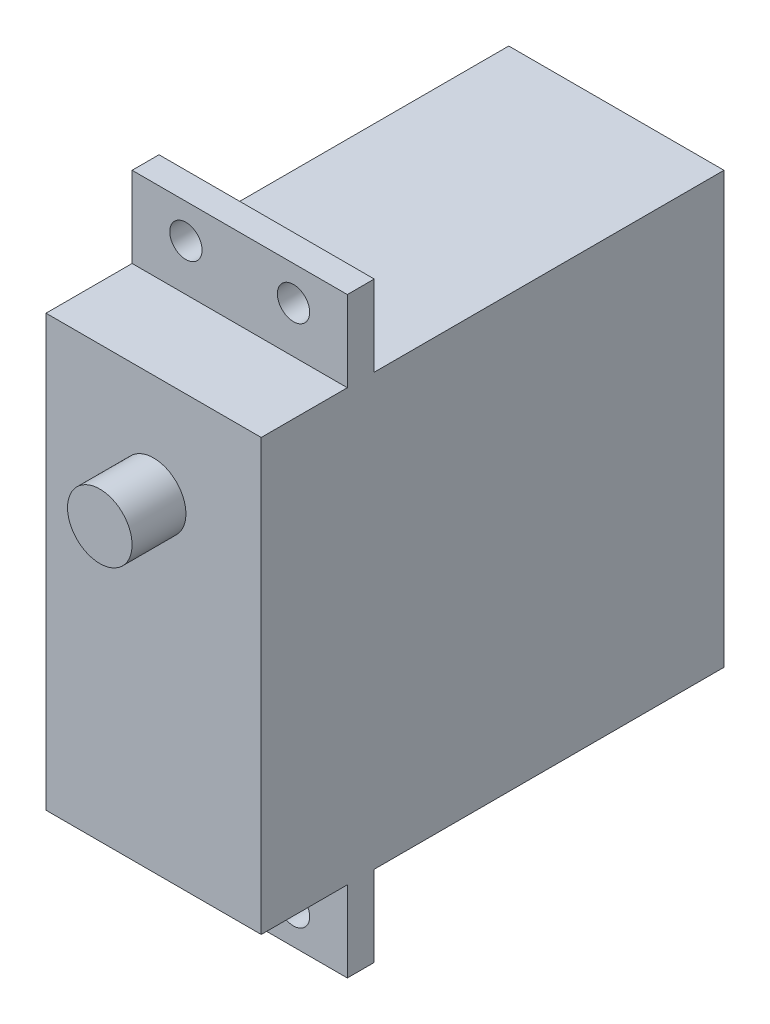
ISO-10303-21;
HEADER;
FILE_DESCRIPTION(('STEP AP214'),'2;1');
FILE_NAME('part.step','',(''),(''),'','','');
FILE_SCHEMA(('AUTOMOTIVE_DESIGN { 1 0 10303 214 1 1 1 1 }'));
ENDSEC;
DATA;
#1=APPLICATION_CONTEXT('core data for automotive mechanical design processes');
#2=APPLICATION_PROTOCOL_DEFINITION('international standard','automotive_design',2000,#1);
#3=PRODUCT_CONTEXT('',#1,'mechanical');
#4=PRODUCT('Part','Part','',(#3));
#5=PRODUCT_RELATED_PRODUCT_CATEGORY('part','',(#4));
#6=PRODUCT_DEFINITION_FORMATION('','',#4);
#7=PRODUCT_DEFINITION_CONTEXT('part definition',#1,'design');
#8=PRODUCT_DEFINITION('design','',#6,#7);
#9=PRODUCT_DEFINITION_SHAPE('','',#8);
#10=(LENGTH_UNIT() NAMED_UNIT(*) SI_UNIT(.MILLI.,.METRE.));
#11=(NAMED_UNIT(*) PLANE_ANGLE_UNIT() SI_UNIT($,.RADIAN.));
#12=(NAMED_UNIT(*) SI_UNIT($,.STERADIAN.) SOLID_ANGLE_UNIT());
#13=UNCERTAINTY_MEASURE_WITH_UNIT(LENGTH_MEASURE(1.E-05),#10,'distance_accuracy_value','');
#14=(GEOMETRIC_REPRESENTATION_CONTEXT(3) GLOBAL_UNCERTAINTY_ASSIGNED_CONTEXT((#13)) GLOBAL_UNIT_ASSIGNED_CONTEXT((#10,
#11,#12)) REPRESENTATION_CONTEXT('',''));
#15=CARTESIAN_POINT('',(0.,0.,0.));
#16=DIRECTION('',(0.,0.,1.));
#17=DIRECTION('',(1.,0.,0.));
#18=AXIS2_PLACEMENT_3D('',#15,#16,#17);
#19=CARTESIAN_POINT('',(0.,0.,43.));
#20=DIRECTION('',(0.,0.,-1.));
#21=DIRECTION('',(-1.,0.,0.));
#22=AXIS2_PLACEMENT_3D('',#19,#20,#21);
#23=PLANE('',#22);
#24=DIRECTION('',(0.,1.,0.));
#25=VECTOR('',#24,1.);
#26=CARTESIAN_POINT('',(10.,-20.,43.));
#27=LINE('',#26,#25);
#28=CARTESIAN_POINT('',(10.,-20.,43.));
#29=VERTEX_POINT('',#28);
#30=CARTESIAN_POINT('',(10.,20.,43.));
#31=VERTEX_POINT('',#30);
#32=EDGE_CURVE('E139',#29,#31,#27,.T.);
#33=ORIENTED_EDGE('',*,*,#32,.T.);
#34=DIRECTION('',(-1.,0.,0.));
#35=VECTOR('',#34,1.);
#36=CARTESIAN_POINT('',(-10.,20.,43.));
#37=LINE('',#36,#35);
#38=CARTESIAN_POINT('',(-10.,20.,43.));
#39=VERTEX_POINT('',#38);
#40=EDGE_CURVE('E129',#31,#39,#37,.T.);
#41=ORIENTED_EDGE('',*,*,#40,.T.);
#42=DIRECTION('',(0.,-1.,0.));
#43=VECTOR('',#42,1.);
#44=CARTESIAN_POINT('',(-10.,-20.,43.));
#45=LINE('',#44,#43);
#46=CARTESIAN_POINT('',(-10.,-20.,43.));
#47=VERTEX_POINT('',#46);
#48=EDGE_CURVE('E138',#39,#47,#45,.T.);
#49=ORIENTED_EDGE('',*,*,#48,.T.);
#50=DIRECTION('',(1.,0.,0.));
#51=VECTOR('',#50,1.);
#52=CARTESIAN_POINT('',(-10.,-20.,43.));
#53=LINE('',#52,#51);
#54=EDGE_CURVE('E144',#47,#29,#53,.T.);
#55=ORIENTED_EDGE('',*,*,#54,.T.);
#56=EDGE_LOOP('',(#33,#41,#49,#55));
#57=FACE_BOUND('',#56,.T.);
#58=CARTESIAN_POINT('',(0.,10.35,43.));
#59=DIRECTION('',(0.,0.,-1.));
#60=DIRECTION('',(-1.,0.,0.));
#61=AXIS2_PLACEMENT_3D('',#58,#59,#60);
#62=CIRCLE('',#61,3.);
#63=CARTESIAN_POINT('',(-3.,10.35,43.));
#64=VERTEX_POINT('',#63);
#65=EDGE_CURVE('E12',#64,#64,#62,.F.);
#66=ORIENTED_EDGE('',*,*,#65,.F.);
#67=EDGE_LOOP('',(#66));
#68=FACE_BOUND('',#67,.T.);
#69=ADVANCED_FACE('F38',(#57,#68),#23,.F.);
#70=CARTESIAN_POINT('',(0.,0.,35.));
#71=DIRECTION('',(0.,0.,-1.));
#72=DIRECTION('',(-1.,0.,0.));
#73=AXIS2_PLACEMENT_3D('',#70,#71,#72);
#74=PLANE('',#73);
#75=CARTESIAN_POINT('',(5.,-24.315,35.));
#76=DIRECTION('',(0.,0.,1.));
#77=DIRECTION('',(1.,0.,0.));
#78=AXIS2_PLACEMENT_3D('',#75,#76,#77);
#79=CIRCLE('',#78,1.5);
#80=CARTESIAN_POINT('',(6.5,-24.315,35.));
#81=VERTEX_POINT('',#80);
#82=EDGE_CURVE('E312',#81,#81,#79,.T.);
#83=ORIENTED_EDGE('',*,*,#82,.F.);
#84=EDGE_LOOP('',(#83));
#85=FACE_BOUND('',#84,.T.);
#86=CARTESIAN_POINT('',(-5.,-24.315,35.));
#87=DIRECTION('',(0.,0.,1.));
#88=DIRECTION('',(1.,0.,0.));
#89=AXIS2_PLACEMENT_3D('',#86,#87,#88);
#90=CIRCLE('',#89,1.5);
#91=CARTESIAN_POINT('',(-3.5,-24.315,35.));
#92=VERTEX_POINT('',#91);
#93=EDGE_CURVE('E303',#92,#92,#90,.T.);
#94=ORIENTED_EDGE('',*,*,#93,.F.);
#95=EDGE_LOOP('',(#94));
#96=FACE_BOUND('',#95,.T.);
#97=DIRECTION('',(1.,0.,0.));
#98=VECTOR('',#97,1.);
#99=CARTESIAN_POINT('',(-10.,-20.,35.));
#100=LINE('',#99,#98);
#101=CARTESIAN_POINT('',(-10.,-20.,35.));
#102=VERTEX_POINT('',#101);
#103=CARTESIAN_POINT('',(10.,-20.,35.));
#104=VERTEX_POINT('',#103);
#105=EDGE_CURVE('E55',#102,#104,#100,.T.);
#106=ORIENTED_EDGE('',*,*,#105,.F.);
#107=DIRECTION('',(0.,-1.,0.));
#108=VECTOR('',#107,1.);
#109=CARTESIAN_POINT('',(-10.,-27.5,35.));
#110=LINE('',#109,#108);
#111=CARTESIAN_POINT('',(-10.,-27.5,35.));
#112=VERTEX_POINT('',#111);
#113=EDGE_CURVE('E272',#102,#112,#110,.T.);
#114=ORIENTED_EDGE('',*,*,#113,.T.);
#115=DIRECTION('',(1.,0.,0.));
#116=VECTOR('',#115,1.);
#117=CARTESIAN_POINT('',(-10.,-27.5,35.));
#118=LINE('',#117,#116);
#119=CARTESIAN_POINT('',(10.,-27.5,35.));
#120=VERTEX_POINT('',#119);
#121=EDGE_CURVE('E245',#112,#120,#118,.T.);
#122=ORIENTED_EDGE('',*,*,#121,.T.);
#123=DIRECTION('',(0.,1.,0.));
#124=VECTOR('',#123,1.);
#125=CARTESIAN_POINT('',(10.,-27.5,35.));
#126=LINE('',#125,#124);
#127=EDGE_CURVE('E180',#120,#104,#126,.T.);
#128=ORIENTED_EDGE('',*,*,#127,.T.);
#129=EDGE_LOOP('',(#106,#114,#122,#128));
#130=FACE_BOUND('',#129,.T.);
#131=ADVANCED_FACE('F319',(#85,#96,#130),#74,.F.);
#132=CARTESIAN_POINT('',(5.,24.315,35.));
#133=DIRECTION('',(0.,0.,1.));
#134=DIRECTION('',(1.,0.,0.));
#135=AXIS2_PLACEMENT_3D('',#132,#133,#134);
#136=CIRCLE('',#135,1.5);
#137=CARTESIAN_POINT('',(6.5,24.315,35.));
#138=VERTEX_POINT('',#137);
#139=EDGE_CURVE('E300',#138,#138,#136,.T.);
#140=ORIENTED_EDGE('',*,*,#139,.F.);
#141=EDGE_LOOP('',(#140));
#142=FACE_BOUND('',#141,.T.);
#143=CARTESIAN_POINT('',(-5.,24.315,35.));
#144=DIRECTION('',(0.,0.,1.));
#145=DIRECTION('',(1.,0.,0.));
#146=AXIS2_PLACEMENT_3D('',#143,#144,#145);
#147=CIRCLE('',#146,1.5);
#148=CARTESIAN_POINT('',(-3.5,24.315,35.));
#149=VERTEX_POINT('',#148);
#150=EDGE_CURVE('E285',#149,#149,#147,.T.);
#151=ORIENTED_EDGE('',*,*,#150,.F.);
#152=EDGE_LOOP('',(#151));
#153=FACE_BOUND('',#152,.T.);
#154=DIRECTION('',(-1.,0.,0.));
#155=VECTOR('',#154,1.);
#156=CARTESIAN_POINT('',(-10.,20.,35.));
#157=LINE('',#156,#155);
#158=CARTESIAN_POINT('',(10.,20.,35.));
#159=VERTEX_POINT('',#158);
#160=CARTESIAN_POINT('',(-10.,20.,35.));
#161=VERTEX_POINT('',#160);
#162=EDGE_CURVE('E63',#159,#161,#157,.T.);
#163=ORIENTED_EDGE('',*,*,#162,.F.);
#164=CARTESIAN_POINT('',(10.,27.5,35.));
#165=VERTEX_POINT('',#164);
#166=EDGE_CURVE('E151',#159,#165,#126,.T.);
#167=ORIENTED_EDGE('',*,*,#166,.T.);
#168=DIRECTION('',(-1.,0.,0.));
#169=VECTOR('',#168,1.);
#170=CARTESIAN_POINT('',(-10.,27.5,35.));
#171=LINE('',#170,#169);
#172=CARTESIAN_POINT('',(-10.,27.5,35.));
#173=VERTEX_POINT('',#172);
#174=EDGE_CURVE('E174',#165,#173,#171,.T.);
#175=ORIENTED_EDGE('',*,*,#174,.T.);
#176=EDGE_CURVE('E271',#173,#161,#110,.T.);
#177=ORIENTED_EDGE('',*,*,#176,.T.);
#178=EDGE_LOOP('',(#163,#167,#175,#177));
#179=FACE_BOUND('',#178,.T.);
#180=ADVANCED_FACE('F322',(#142,#153,#179),#74,.F.);
#181=CARTESIAN_POINT('',(10.,-20.,32.5));
#182=DIRECTION('',(-1.,0.,0.));
#183=DIRECTION('',(0.,0.,1.));
#184=AXIS2_PLACEMENT_3D('',#181,#182,#183);
#185=PLANE('',#184);
#186=DIRECTION('',(0.,1.,0.));
#187=VECTOR('',#186,1.);
#188=CARTESIAN_POINT('',(10.,-20.,0.));
#189=LINE('',#188,#187);
#190=CARTESIAN_POINT('',(10.,-20.,0.));
#191=VERTEX_POINT('',#190);
#192=CARTESIAN_POINT('',(10.,20.,0.));
#193=VERTEX_POINT('',#192);
#194=EDGE_CURVE('E208',#191,#193,#189,.T.);
#195=ORIENTED_EDGE('',*,*,#194,.T.);
#196=DIRECTION('',(0.,0.,-1.));
#197=VECTOR('',#196,1.);
#198=CARTESIAN_POINT('',(10.,20.,32.5));
#199=LINE('',#198,#197);
#200=CARTESIAN_POINT('',(10.,20.,32.5));
#201=VERTEX_POINT('',#200);
#202=EDGE_CURVE('E47',#201,#193,#199,.T.);
#203=ORIENTED_EDGE('',*,*,#202,.F.);
#204=DIRECTION('',(0.,1.,0.));
#205=VECTOR('',#204,1.);
#206=CARTESIAN_POINT('',(10.,-27.5,32.5));
#207=LINE('',#206,#205);
#208=CARTESIAN_POINT('',(10.,27.5,32.5));
#209=VERTEX_POINT('',#208);
#210=EDGE_CURVE('E152',#201,#209,#207,.T.);
#211=ORIENTED_EDGE('',*,*,#210,.T.);
#212=DIRECTION('',(0.,0.,-1.));
#213=VECTOR('',#212,1.);
#214=CARTESIAN_POINT('',(10.,27.5,35.));
#215=LINE('',#214,#213);
#216=EDGE_CURVE('E228',#165,#209,#215,.T.);
#217=ORIENTED_EDGE('',*,*,#216,.F.);
#218=ORIENTED_EDGE('',*,*,#166,.F.);
#219=DIRECTION('',(0.,0.,-1.));
#220=VECTOR('',#219,1.);
#221=CARTESIAN_POINT('',(10.,20.,43.));
#222=LINE('',#221,#220);
#223=EDGE_CURVE('E133',#31,#159,#222,.T.);
#224=ORIENTED_EDGE('',*,*,#223,.F.);
#225=ORIENTED_EDGE('',*,*,#32,.F.);
#226=DIRECTION('',(0.,0.,-1.));
#227=VECTOR('',#226,1.);
#228=CARTESIAN_POINT('',(10.,-20.,43.));
#229=LINE('',#228,#227);
#230=EDGE_CURVE('E165',#29,#104,#229,.T.);
#231=ORIENTED_EDGE('',*,*,#230,.T.);
#232=ORIENTED_EDGE('',*,*,#127,.F.);
#233=DIRECTION('',(0.,0.,-1.));
#234=VECTOR('',#233,1.);
#235=CARTESIAN_POINT('',(10.,-27.5,35.));
#236=LINE('',#235,#234);
#237=CARTESIAN_POINT('',(10.,-27.5,32.5));
#238=VERTEX_POINT('',#237);
#239=EDGE_CURVE('E267',#120,#238,#236,.T.);
#240=ORIENTED_EDGE('',*,*,#239,.T.);
#241=CARTESIAN_POINT('',(10.,-20.,32.5));
#242=VERTEX_POINT('',#241);
#243=EDGE_CURVE('E154',#238,#242,#207,.T.);
#244=ORIENTED_EDGE('',*,*,#243,.T.);
#245=DIRECTION('',(0.,0.,-1.));
#246=VECTOR('',#245,1.);
#247=CARTESIAN_POINT('',(10.,-20.,32.5));
#248=LINE('',#247,#246);
#249=EDGE_CURVE('E213',#242,#191,#248,.T.);
#250=ORIENTED_EDGE('',*,*,#249,.T.);
#251=EDGE_LOOP('',(#195,#203,#211,#217,#218,#224,#225,#231,#232,#240,#244,#250));
#252=FACE_BOUND('',#251,.T.);
#253=ADVANCED_FACE('F40',(#252),#185,.F.);
#254=CARTESIAN_POINT('',(-10.,20.,32.5));
#255=DIRECTION('',(0.,-1.,0.));
#256=DIRECTION('',(0.,0.,-1.));
#257=AXIS2_PLACEMENT_3D('',#254,#255,#256);
#258=PLANE('',#257);
#259=DIRECTION('',(-1.,0.,0.));
#260=VECTOR('',#259,1.);
#261=CARTESIAN_POINT('',(-10.,20.,0.));
#262=LINE('',#261,#260);
#263=CARTESIAN_POINT('',(-10.,20.,0.));
#264=VERTEX_POINT('',#263);
#265=EDGE_CURVE('E226',#193,#264,#262,.T.);
#266=ORIENTED_EDGE('',*,*,#265,.T.);
#267=DIRECTION('',(0.,0.,-1.));
#268=VECTOR('',#267,1.);
#269=CARTESIAN_POINT('',(-10.,20.,32.5));
#270=LINE('',#269,#268);
#271=CARTESIAN_POINT('',(-10.,20.,32.5));
#272=VERTEX_POINT('',#271);
#273=EDGE_CURVE('E186',#272,#264,#270,.T.);
#274=ORIENTED_EDGE('',*,*,#273,.F.);
#275=DIRECTION('',(-1.,0.,0.));
#276=VECTOR('',#275,1.);
#277=CARTESIAN_POINT('',(-10.,20.,32.5));
#278=LINE('',#277,#276);
#279=EDGE_CURVE('E192',#201,#272,#278,.T.);
#280=ORIENTED_EDGE('',*,*,#279,.F.);
#281=ORIENTED_EDGE('',*,*,#202,.T.);
#282=EDGE_LOOP('',(#266,#274,#280,#281));
#283=FACE_BOUND('',#282,.T.);
#284=ADVANCED_FACE('F350',(#283),#258,.F.);
#285=CARTESIAN_POINT('',(-10.,-20.,32.5));
#286=DIRECTION('',(1.,0.,0.));
#287=DIRECTION('',(0.,0.,-1.));
#288=AXIS2_PLACEMENT_3D('',#285,#286,#287);
#289=PLANE('',#288);
#290=DIRECTION('',(0.,-1.,0.));
#291=VECTOR('',#290,1.);
#292=CARTESIAN_POINT('',(-10.,-20.,0.));
#293=LINE('',#292,#291);
#294=CARTESIAN_POINT('',(-10.,-20.,0.));
#295=VERTEX_POINT('',#294);
#296=EDGE_CURVE('E225',#264,#295,#293,.T.);
#297=ORIENTED_EDGE('',*,*,#296,.T.);
#298=DIRECTION('',(0.,0.,-1.));
#299=VECTOR('',#298,1.);
#300=CARTESIAN_POINT('',(-10.,-20.,32.5));
#301=LINE('',#300,#299);
#302=CARTESIAN_POINT('',(-10.,-20.,32.5));
#303=VERTEX_POINT('',#302);
#304=EDGE_CURVE('E191',#303,#295,#301,.T.);
#305=ORIENTED_EDGE('',*,*,#304,.F.);
#306=DIRECTION('',(0.,-1.,0.));
#307=VECTOR('',#306,1.);
#308=CARTESIAN_POINT('',(-10.,-27.5,32.5));
#309=LINE('',#308,#307);
#310=CARTESIAN_POINT('',(-10.,-27.5,32.5));
#311=VERTEX_POINT('',#310);
#312=EDGE_CURVE('E203',#303,#311,#309,.T.);
#313=ORIENTED_EDGE('',*,*,#312,.T.);
#314=DIRECTION('',(0.,0.,-1.));
#315=VECTOR('',#314,1.);
#316=CARTESIAN_POINT('',(-10.,-27.5,35.));
#317=LINE('',#316,#315);
#318=EDGE_CURVE('E236',#112,#311,#317,.T.);
#319=ORIENTED_EDGE('',*,*,#318,.F.);
#320=ORIENTED_EDGE('',*,*,#113,.F.);
#321=DIRECTION('',(0.,0.,-1.));
#322=VECTOR('',#321,1.);
#323=CARTESIAN_POINT('',(-10.,-20.,43.));
#324=LINE('',#323,#322);
#325=EDGE_CURVE('E156',#47,#102,#324,.T.);
#326=ORIENTED_EDGE('',*,*,#325,.F.);
#327=ORIENTED_EDGE('',*,*,#48,.F.);
#328=DIRECTION('',(0.,0.,-1.));
#329=VECTOR('',#328,1.);
#330=CARTESIAN_POINT('',(-10.,20.,43.));
#331=LINE('',#330,#329);
#332=EDGE_CURVE('E135',#39,#161,#331,.T.);
#333=ORIENTED_EDGE('',*,*,#332,.T.);
#334=ORIENTED_EDGE('',*,*,#176,.F.);
#335=DIRECTION('',(0.,0.,-1.));
#336=VECTOR('',#335,1.);
#337=CARTESIAN_POINT('',(-10.,27.5,35.));
#338=LINE('',#337,#336);
#339=CARTESIAN_POINT('',(-10.,27.5,32.5));
#340=VERTEX_POINT('',#339);
#341=EDGE_CURVE('E231',#173,#340,#338,.T.);
#342=ORIENTED_EDGE('',*,*,#341,.T.);
#343=EDGE_CURVE('E252',#340,#272,#309,.T.);
#344=ORIENTED_EDGE('',*,*,#343,.T.);
#345=ORIENTED_EDGE('',*,*,#273,.T.);
#346=EDGE_LOOP('',(#297,#305,#313,#319,#320,#326,#327,#333,#334,#342,#344,#345));
#347=FACE_BOUND('',#346,.T.);
#348=ADVANCED_FACE('F259',(#347),#289,.F.);
#349=CARTESIAN_POINT('',(-10.,-20.,32.5));
#350=DIRECTION('',(0.,1.,0.));
#351=DIRECTION('',(0.,0.,1.));
#352=AXIS2_PLACEMENT_3D('',#349,#350,#351);
#353=PLANE('',#352);
#354=DIRECTION('',(1.,0.,0.));
#355=VECTOR('',#354,1.);
#356=CARTESIAN_POINT('',(-10.,-20.,0.));
#357=LINE('',#356,#355);
#358=EDGE_CURVE('E197',#295,#191,#357,.T.);
#359=ORIENTED_EDGE('',*,*,#358,.T.);
#360=ORIENTED_EDGE('',*,*,#249,.F.);
#361=DIRECTION('',(1.,0.,0.));
#362=VECTOR('',#361,1.);
#363=CARTESIAN_POINT('',(-10.,-20.,32.5));
#364=LINE('',#363,#362);
#365=EDGE_CURVE('E196',#303,#242,#364,.T.);
#366=ORIENTED_EDGE('',*,*,#365,.F.);
#367=ORIENTED_EDGE('',*,*,#304,.T.);
#368=EDGE_LOOP('',(#359,#360,#366,#367));
#369=FACE_BOUND('',#368,.T.);
#370=ADVANCED_FACE('F345',(#369),#353,.F.);
#371=CARTESIAN_POINT('',(0.,0.,0.));
#372=DIRECTION('',(0.,0.,-1.));
#373=DIRECTION('',(-1.,0.,0.));
#374=AXIS2_PLACEMENT_3D('',#371,#372,#373);
#375=PLANE('',#374);
#376=ORIENTED_EDGE('',*,*,#194,.F.);
#377=ORIENTED_EDGE('',*,*,#358,.F.);
#378=ORIENTED_EDGE('',*,*,#296,.F.);
#379=ORIENTED_EDGE('',*,*,#265,.F.);
#380=EDGE_LOOP('',(#376,#377,#378,#379));
#381=FACE_BOUND('',#380,.T.);
#382=ADVANCED_FACE('F342',(#381),#375,.T.);
#383=CARTESIAN_POINT('',(0.,0.,32.5));
#384=DIRECTION('',(0.,0.,-1.));
#385=DIRECTION('',(-1.,0.,0.));
#386=AXIS2_PLACEMENT_3D('',#383,#384,#385);
#387=PLANE('',#386);
#388=CARTESIAN_POINT('',(5.,24.315,32.5));
#389=DIRECTION('',(0.,0.,-1.));
#390=DIRECTION('',(-1.,0.,0.));
#391=AXIS2_PLACEMENT_3D('',#388,#389,#390);
#392=CIRCLE('',#391,1.5);
#393=CARTESIAN_POINT('',(3.5,24.315,32.5));
#394=VERTEX_POINT('',#393);
#395=EDGE_CURVE('E298',#394,#394,#392,.T.);
#396=ORIENTED_EDGE('',*,*,#395,.F.);
#397=EDGE_LOOP('',(#396));
#398=FACE_BOUND('',#397,.T.);
#399=CARTESIAN_POINT('',(-5.,24.315,32.5));
#400=DIRECTION('',(0.,0.,-1.));
#401=DIRECTION('',(-1.,0.,0.));
#402=AXIS2_PLACEMENT_3D('',#399,#400,#401);
#403=CIRCLE('',#402,1.5);
#404=CARTESIAN_POINT('',(-6.50000000000001,24.315,32.5));
#405=VERTEX_POINT('',#404);
#406=EDGE_CURVE('E280',#405,#405,#403,.T.);
#407=ORIENTED_EDGE('',*,*,#406,.F.);
#408=EDGE_LOOP('',(#407));
#409=FACE_BOUND('',#408,.T.);
#410=ORIENTED_EDGE('',*,*,#210,.F.);
#411=ORIENTED_EDGE('',*,*,#279,.T.);
#412=ORIENTED_EDGE('',*,*,#343,.F.);
#413=DIRECTION('',(-1.,0.,0.));
#414=VECTOR('',#413,1.);
#415=CARTESIAN_POINT('',(-10.,27.5,32.5));
#416=LINE('',#415,#414);
#417=EDGE_CURVE('E241',#209,#340,#416,.T.);
#418=ORIENTED_EDGE('',*,*,#417,.F.);
#419=EDGE_LOOP('',(#410,#411,#412,#418));
#420=FACE_BOUND('',#419,.T.);
#421=ADVANCED_FACE('F336',(#398,#409,#420),#387,.T.);
#422=CARTESIAN_POINT('',(-10.,27.5,35.));
#423=DIRECTION('',(0.,-1.,0.));
#424=DIRECTION('',(0.,0.,-1.));
#425=AXIS2_PLACEMENT_3D('',#422,#423,#424);
#426=PLANE('',#425);
#427=ORIENTED_EDGE('',*,*,#417,.T.);
#428=ORIENTED_EDGE('',*,*,#341,.F.);
#429=ORIENTED_EDGE('',*,*,#174,.F.);
#430=ORIENTED_EDGE('',*,*,#216,.T.);
#431=EDGE_LOOP('',(#427,#428,#429,#430));
#432=FACE_BOUND('',#431,.T.);
#433=ADVANCED_FACE('F339',(#432),#426,.F.);
#434=CARTESIAN_POINT('',(-10.,-27.5,35.));
#435=DIRECTION('',(0.,1.,0.));
#436=DIRECTION('',(0.,0.,1.));
#437=AXIS2_PLACEMENT_3D('',#434,#435,#436);
#438=PLANE('',#437);
#439=DIRECTION('',(1.,0.,0.));
#440=VECTOR('',#439,1.);
#441=CARTESIAN_POINT('',(-10.,-27.5,32.5));
#442=LINE('',#441,#440);
#443=EDGE_CURVE('E249',#311,#238,#442,.T.);
#444=ORIENTED_EDGE('',*,*,#443,.T.);
#445=ORIENTED_EDGE('',*,*,#239,.F.);
#446=ORIENTED_EDGE('',*,*,#121,.F.);
#447=ORIENTED_EDGE('',*,*,#318,.T.);
#448=EDGE_LOOP('',(#444,#445,#446,#447));
#449=FACE_BOUND('',#448,.T.);
#450=ADVANCED_FACE('F264',(#449),#438,.F.);
#451=CARTESIAN_POINT('',(5.,-24.315,32.5));
#452=DIRECTION('',(0.,0.,-1.));
#453=DIRECTION('',(-1.,0.,0.));
#454=AXIS2_PLACEMENT_3D('',#451,#452,#453);
#455=CIRCLE('',#454,1.5);
#456=CARTESIAN_POINT('',(3.5,-24.315,32.5));
#457=VERTEX_POINT('',#456);
#458=EDGE_CURVE('E42',#457,#457,#455,.T.);
#459=ORIENTED_EDGE('',*,*,#458,.F.);
#460=EDGE_LOOP('',(#459));
#461=FACE_BOUND('',#460,.T.);
#462=CARTESIAN_POINT('',(-5.,-24.315,32.5));
#463=DIRECTION('',(0.,0.,-1.));
#464=DIRECTION('',(-1.,0.,0.));
#465=AXIS2_PLACEMENT_3D('',#462,#463,#464);
#466=CIRCLE('',#465,1.5);
#467=CARTESIAN_POINT('',(-6.5,-24.315,32.5));
#468=VERTEX_POINT('',#467);
#469=EDGE_CURVE('E301',#468,#468,#466,.T.);
#470=ORIENTED_EDGE('',*,*,#469,.F.);
#471=EDGE_LOOP('',(#470));
#472=FACE_BOUND('',#471,.T.);
#473=ORIENTED_EDGE('',*,*,#312,.F.);
#474=ORIENTED_EDGE('',*,*,#365,.T.);
#475=ORIENTED_EDGE('',*,*,#243,.F.);
#476=ORIENTED_EDGE('',*,*,#443,.F.);
#477=EDGE_LOOP('',(#473,#474,#475,#476));
#478=FACE_BOUND('',#477,.T.);
#479=ADVANCED_FACE('F269',(#461,#472,#478),#387,.T.);
#480=CARTESIAN_POINT('',(-10.,20.,43.));
#481=DIRECTION('',(0.,-1.,0.));
#482=DIRECTION('',(0.,0.,-1.));
#483=AXIS2_PLACEMENT_3D('',#480,#481,#482);
#484=PLANE('',#483);
#485=ORIENTED_EDGE('',*,*,#162,.T.);
#486=ORIENTED_EDGE('',*,*,#332,.F.);
#487=ORIENTED_EDGE('',*,*,#40,.F.);
#488=ORIENTED_EDGE('',*,*,#223,.T.);
#489=EDGE_LOOP('',(#485,#486,#487,#488));
#490=FACE_BOUND('',#489,.T.);
#491=ADVANCED_FACE('F131',(#490),#484,.F.);
#492=CARTESIAN_POINT('',(-10.,-20.,43.));
#493=DIRECTION('',(0.,1.,0.));
#494=DIRECTION('',(0.,0.,1.));
#495=AXIS2_PLACEMENT_3D('',#492,#493,#494);
#496=PLANE('',#495);
#497=ORIENTED_EDGE('',*,*,#105,.T.);
#498=ORIENTED_EDGE('',*,*,#230,.F.);
#499=ORIENTED_EDGE('',*,*,#54,.F.);
#500=ORIENTED_EDGE('',*,*,#325,.T.);
#501=EDGE_LOOP('',(#497,#498,#499,#500));
#502=FACE_BOUND('',#501,.T.);
#503=ADVANCED_FACE('F434',(#502),#496,.F.);
#504=CARTESIAN_POINT('',(0.,10.35,104.485281374239));
#505=DIRECTION('',(0.,0.,-1.));
#506=DIRECTION('',(-1.,0.,0.));
#507=AXIS2_PLACEMENT_3D('',#504,#505,#506);
#508=CYLINDRICAL_SURFACE('',#507,3.);
#509=CARTESIAN_POINT('',(0.,10.35,48.));
#510=DIRECTION('',(0.,0.,-1.));
#511=DIRECTION('',(-1.,0.,0.));
#512=AXIS2_PLACEMENT_3D('',#509,#510,#511);
#513=CIRCLE('',#512,3.);
#514=CARTESIAN_POINT('',(-3.,10.35,48.));
#515=VERTEX_POINT('',#514);
#516=EDGE_CURVE('E278',#515,#515,#513,.T.);
#517=ORIENTED_EDGE('',*,*,#516,.T.);
#518=EDGE_LOOP('',(#517));
#519=FACE_BOUND('',#518,.T.);
#520=ORIENTED_EDGE('',*,*,#65,.T.);
#521=EDGE_LOOP('',(#520));
#522=FACE_BOUND('',#521,.T.);
#523=ADVANCED_FACE('F431',(#519,#522),#508,.T.);
#524=CARTESIAN_POINT('',(0.,0.,48.));
#525=DIRECTION('',(0.,0.,-1.));
#526=DIRECTION('',(-1.,0.,0.));
#527=AXIS2_PLACEMENT_3D('',#524,#525,#526);
#528=PLANE('',#527);
#529=ORIENTED_EDGE('',*,*,#516,.F.);
#530=EDGE_LOOP('',(#529));
#531=FACE_BOUND('',#530,.T.);
#532=ADVANCED_FACE('F395',(#531),#528,.F.);
#533=CARTESIAN_POINT('',(-5.,24.315,-2.50000000007189E-05));
#534=DIRECTION('',(0.,0.,1.));
#535=DIRECTION('',(1.,0.,0.));
#536=AXIS2_PLACEMENT_3D('',#533,#534,#535);
#537=CYLINDRICAL_SURFACE('',#536,1.5);
#538=ORIENTED_EDGE('',*,*,#406,.T.);
#539=EDGE_LOOP('',(#538));
#540=FACE_BOUND('',#539,.T.);
#541=ORIENTED_EDGE('',*,*,#150,.T.);
#542=EDGE_LOOP('',(#541));
#543=FACE_BOUND('',#542,.T.);
#544=ADVANCED_FACE('F389',(#540,#543),#537,.F.);
#545=CARTESIAN_POINT('',(5.,24.315,-2.50000000007189E-05));
#546=DIRECTION('',(0.,0.,1.));
#547=DIRECTION('',(1.,0.,0.));
#548=AXIS2_PLACEMENT_3D('',#545,#546,#547);
#549=CYLINDRICAL_SURFACE('',#548,1.5);
#550=ORIENTED_EDGE('',*,*,#395,.T.);
#551=EDGE_LOOP('',(#550));
#552=FACE_BOUND('',#551,.T.);
#553=ORIENTED_EDGE('',*,*,#139,.T.);
#554=EDGE_LOOP('',(#553));
#555=FACE_BOUND('',#554,.T.);
#556=ADVANCED_FACE('F394',(#552,#555),#549,.F.);
#557=CARTESIAN_POINT('',(-5.,-24.315,-2.50000000007189E-05));
#558=DIRECTION('',(0.,0.,1.));
#559=DIRECTION('',(1.,0.,0.));
#560=AXIS2_PLACEMENT_3D('',#557,#558,#559);
#561=CYLINDRICAL_SURFACE('',#560,1.5);
#562=ORIENTED_EDGE('',*,*,#469,.T.);
#563=EDGE_LOOP('',(#562));
#564=FACE_BOUND('',#563,.T.);
#565=ORIENTED_EDGE('',*,*,#93,.T.);
#566=EDGE_LOOP('',(#565));
#567=FACE_BOUND('',#566,.T.);
#568=ADVANCED_FACE('F407',(#564,#567),#561,.F.);
#569=CARTESIAN_POINT('',(5.,-24.315,-2.50000000007189E-05));
#570=DIRECTION('',(0.,0.,1.));
#571=DIRECTION('',(1.,0.,0.));
#572=AXIS2_PLACEMENT_3D('',#569,#570,#571);
#573=CYLINDRICAL_SURFACE('',#572,1.5);
#574=ORIENTED_EDGE('',*,*,#458,.T.);
#575=EDGE_LOOP('',(#574));
#576=FACE_BOUND('',#575,.T.);
#577=ORIENTED_EDGE('',*,*,#82,.T.);
#578=EDGE_LOOP('',(#577));
#579=FACE_BOUND('',#578,.T.);
#580=ADVANCED_FACE('F317',(#576,#579),#573,.F.);
#581=CLOSED_SHELL('',(#69,#131,#180,#253,#284,#348,#370,#382,#421,#433,#450,#479,#491,#503,#523,
#532,#544,#556,#568,#580));
#582=MANIFOLD_SOLID_BREP('B2',#581);
#583=ADVANCED_BREP_SHAPE_REPRESENTATION('',(#18,#582),#14);
#584=SHAPE_DEFINITION_REPRESENTATION(#9,#583);
ENDSEC;
END-ISO-10303-21;
